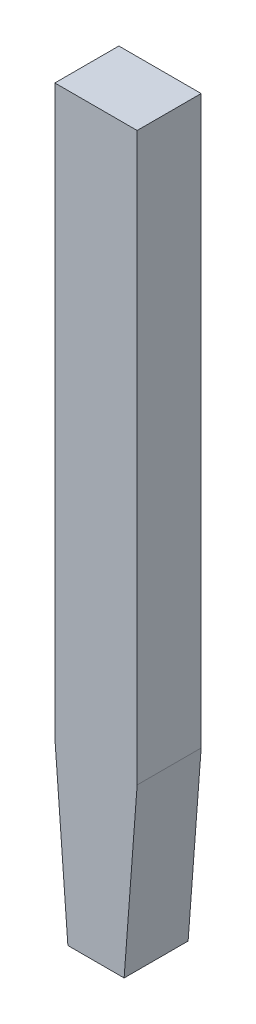
ISO-10303-21;
HEADER;
FILE_DESCRIPTION(('STEP AP214'),'2;1');
FILE_NAME('part.step','',(''),(''),'','','');
FILE_SCHEMA(('AUTOMOTIVE_DESIGN { 1 0 10303 214 1 1 1 1 }'));
ENDSEC;
DATA;
#1=APPLICATION_CONTEXT('core data for automotive mechanical design processes');
#2=APPLICATION_PROTOCOL_DEFINITION('international standard','automotive_design',2000,#1);
#3=PRODUCT_CONTEXT('',#1,'mechanical');
#4=PRODUCT('Part','Part','',(#3));
#5=PRODUCT_RELATED_PRODUCT_CATEGORY('part','',(#4));
#6=PRODUCT_DEFINITION_FORMATION('','',#4);
#7=PRODUCT_DEFINITION_CONTEXT('part definition',#1,'design');
#8=PRODUCT_DEFINITION('design','',#6,#7);
#9=PRODUCT_DEFINITION_SHAPE('','',#8);
#10=(LENGTH_UNIT() NAMED_UNIT(*) SI_UNIT(.MILLI.,.METRE.));
#11=(NAMED_UNIT(*) PLANE_ANGLE_UNIT() SI_UNIT($,.RADIAN.));
#12=(NAMED_UNIT(*) SI_UNIT($,.STERADIAN.) SOLID_ANGLE_UNIT());
#13=UNCERTAINTY_MEASURE_WITH_UNIT(LENGTH_MEASURE(1.E-05),#10,'distance_accuracy_value','');
#14=(GEOMETRIC_REPRESENTATION_CONTEXT(3) GLOBAL_UNCERTAINTY_ASSIGNED_CONTEXT((#13)) GLOBAL_UNIT_ASSIGNED_CONTEXT((#10,
#11,#12)) REPRESENTATION_CONTEXT('',''));
#15=CARTESIAN_POINT('',(0.,0.,0.));
#16=DIRECTION('',(0.,0.,1.));
#17=DIRECTION('',(1.,0.,0.));
#18=AXIS2_PLACEMENT_3D('',#15,#16,#17);
#19=CARTESIAN_POINT('',(45.33457889831,-0.5212621897839,0.8150000000459));
#20=DIRECTION('',(0.,0.,1.));
#21=DIRECTION('',(1.,0.,0.));
#22=AXIS2_PLACEMENT_3D('',#19,#20,#21);
#23=PLANE('',#22);
#24=DIRECTION('',(0.0747899482416361,0.997199309888456,0.));
#25=VECTOR('',#24,1.);
#26=CARTESIAN_POINT('',(45.93832889831,-15.17126218978,0.8150000000459));
#27=LINE('',#26,#25);
#28=CARTESIAN_POINT('',(45.93832889831,-15.17126218978,0.8150000000459));
#29=VERTEX_POINT('',#28);
#30=CARTESIAN_POINT('',(46.00957889831,-14.22126218978,0.8150000000459));
#31=VERTEX_POINT('',#30);
#32=EDGE_CURVE('E83',#29,#31,#27,.T.);
#33=ORIENTED_EDGE('',*,*,#32,.F.);
#34=DIRECTION('',(1.,0.,0.));
#35=VECTOR('',#34,1.);
#36=CARTESIAN_POINT('',(45.33457889831,-15.17126218978,0.8150000000459));
#37=LINE('',#36,#35);
#38=CARTESIAN_POINT('',(45.63082889831,-15.17126218978,0.8150000000459));
#39=VERTEX_POINT('',#38);
#40=EDGE_CURVE('E66',#39,#29,#37,.T.);
#41=ORIENTED_EDGE('',*,*,#40,.F.);
#42=DIRECTION('',(0.0747899482416361,-0.997199309888456,0.));
#43=VECTOR('',#42,1.);
#44=CARTESIAN_POINT('',(45.55957889831,-14.22126218978,0.8150000000459));
#45=LINE('',#44,#43);
#46=CARTESIAN_POINT('',(45.55957889831,-14.2212621897798,0.8150000000459));
#47=VERTEX_POINT('',#46);
#48=EDGE_CURVE('E20',#47,#39,#45,.T.);
#49=ORIENTED_EDGE('',*,*,#48,.F.);
#50=DIRECTION('',(0.,1.,0.));
#51=VECTOR('',#50,1.);
#52=CARTESIAN_POINT('',(45.55957889831,-7.321262189784,0.8150000000459));
#53=LINE('',#52,#51);
#54=CARTESIAN_POINT('',(45.55957889831,-11.12202888849,0.8150000000459));
#55=VERTEX_POINT('',#54);
#56=EDGE_CURVE('E96',#55,#47,#53,.F.);
#57=ORIENTED_EDGE('',*,*,#56,.F.);
#58=DIRECTION('',(1.,0.,0.));
#59=VECTOR('',#58,1.);
#60=CARTESIAN_POINT('',(44.47457889831,-11.12202888849,0.8150000000459));
#61=LINE('',#60,#59);
#62=CARTESIAN_POINT('',(46.00957889831,-11.12202888849,0.8150000000459));
#63=VERTEX_POINT('',#62);
#64=EDGE_CURVE('E89',#55,#63,#61,.T.);
#65=ORIENTED_EDGE('',*,*,#64,.T.);
#66=DIRECTION('',(0.,1.,0.));
#67=VECTOR('',#66,1.);
#68=CARTESIAN_POINT('',(46.00957889831,-7.321262189784,0.8150000000459));
#69=LINE('',#68,#67);
#70=EDGE_CURVE('E84',#31,#63,#69,.T.);
#71=ORIENTED_EDGE('',*,*,#70,.F.);
#72=EDGE_LOOP('',(#33,#41,#49,#57,#65,#71));
#73=FACE_BOUND('',#72,.T.);
#74=ADVANCED_FACE('F17',(#73),#23,.F.);
#75=CARTESIAN_POINT('',(46.00957889831,-7.321262189784,0.8150000000459));
#76=DIRECTION('',(1.,0.,0.));
#77=DIRECTION('',(0.,0.,-1.));
#78=AXIS2_PLACEMENT_3D('',#75,#76,#77);
#79=PLANE('',#78);
#80=DIRECTION('',(0.,1.,0.));
#81=VECTOR('',#80,1.);
#82=CARTESIAN_POINT('',(46.00957889831,-0.5212621897839,1.165000000046));
#83=LINE('',#82,#81);
#84=CARTESIAN_POINT('',(46.00957889831,-14.2212621897799,1.165000000046));
#85=VERTEX_POINT('',#84);
#86=CARTESIAN_POINT('',(46.00957889831,-11.12202888849,1.165000000046));
#87=VERTEX_POINT('',#86);
#88=EDGE_CURVE('E103',#85,#87,#83,.T.);
#89=ORIENTED_EDGE('',*,*,#88,.F.);
#90=DIRECTION('',(0.,0.,1.));
#91=VECTOR('',#90,1.);
#92=CARTESIAN_POINT('',(46.00957889831,-14.22126218978,0.8150000000459));
#93=LINE('',#92,#91);
#94=EDGE_CURVE('E100',#31,#85,#93,.T.);
#95=ORIENTED_EDGE('',*,*,#94,.F.);
#96=ORIENTED_EDGE('',*,*,#70,.T.);
#97=DIRECTION('',(0.,0.,-1.));
#98=VECTOR('',#97,1.);
#99=CARTESIAN_POINT('',(46.00957889831,-11.12202888849,-0.158278306686));
#100=LINE('',#99,#98);
#101=EDGE_CURVE('E91',#63,#87,#100,.F.);
#102=ORIENTED_EDGE('',*,*,#101,.T.);
#103=EDGE_LOOP('',(#89,#95,#96,#102));
#104=FACE_BOUND('',#103,.T.);
#105=ADVANCED_FACE('F124',(#104),#79,.T.);
#106=CARTESIAN_POINT('',(44.47457889831,-11.12202888849,-0.158278306686));
#107=DIRECTION('',(0.,-1.,0.));
#108=DIRECTION('',(0.,0.,-1.));
#109=AXIS2_PLACEMENT_3D('',#106,#107,#108);
#110=PLANE('',#109);
#111=ORIENTED_EDGE('',*,*,#64,.F.);
#112=DIRECTION('',(0.,0.,1.));
#113=VECTOR('',#112,1.);
#114=CARTESIAN_POINT('',(45.55957889831,-11.12202888849,0.8150000000459));
#115=LINE('',#114,#113);
#116=CARTESIAN_POINT('',(45.55957889831,-11.12202888849,1.165000000046));
#117=VERTEX_POINT('',#116);
#118=EDGE_CURVE('E93',#117,#55,#115,.F.);
#119=ORIENTED_EDGE('',*,*,#118,.F.);
#120=DIRECTION('',(1.,0.,0.));
#121=VECTOR('',#120,1.);
#122=CARTESIAN_POINT('',(45.33457889831,-11.12202888849,1.165000000046));
#123=LINE('',#122,#121);
#124=EDGE_CURVE('E106',#87,#117,#123,.F.);
#125=ORIENTED_EDGE('',*,*,#124,.F.);
#126=ORIENTED_EDGE('',*,*,#101,.F.);
#127=EDGE_LOOP('',(#111,#119,#125,#126));
#128=FACE_BOUND('',#127,.T.);
#129=ADVANCED_FACE('F125',(#128),#110,.F.);
#130=CARTESIAN_POINT('',(45.55957889831,-7.321262189784,0.8150000000459));
#131=DIRECTION('',(-1.,0.,0.));
#132=DIRECTION('',(0.,0.,1.));
#133=AXIS2_PLACEMENT_3D('',#130,#131,#132);
#134=PLANE('',#133);
#135=ORIENTED_EDGE('',*,*,#56,.T.);
#136=DIRECTION('',(0.,0.,1.));
#137=VECTOR('',#136,1.);
#138=CARTESIAN_POINT('',(45.55957889831,-14.22126218978,0.8150000000459));
#139=LINE('',#138,#137);
#140=CARTESIAN_POINT('',(45.55957889831,-14.2212621897799,1.165000000046));
#141=VERTEX_POINT('',#140);
#142=EDGE_CURVE('E73',#141,#47,#139,.F.);
#143=ORIENTED_EDGE('',*,*,#142,.F.);
#144=DIRECTION('',(0.,1.,0.));
#145=VECTOR('',#144,1.);
#146=CARTESIAN_POINT('',(45.55957889831,-0.5212621897839,1.165000000046));
#147=LINE('',#146,#145);
#148=EDGE_CURVE('E109',#117,#141,#147,.F.);
#149=ORIENTED_EDGE('',*,*,#148,.F.);
#150=ORIENTED_EDGE('',*,*,#118,.T.);
#151=EDGE_LOOP('',(#135,#143,#149,#150));
#152=FACE_BOUND('',#151,.T.);
#153=ADVANCED_FACE('F119',(#152),#134,.T.);
#154=CARTESIAN_POINT('',(45.55957889831,-14.22126218978,0.8150000000459));
#155=DIRECTION('',(-0.997199309888458,-0.0747899482416168,0.));
#156=DIRECTION('',(0.0747899482416168,-0.997199309888458,0.));
#157=AXIS2_PLACEMENT_3D('',#154,#155,#156);
#158=PLANE('',#157);
#159=DIRECTION('',(0.0747899482416361,-0.997199309888456,0.));
#160=VECTOR('',#159,1.);
#161=CARTESIAN_POINT('',(45.55957889831,-14.22126218978,1.165000000046));
#162=LINE('',#161,#160);
#163=CARTESIAN_POINT('',(45.63082889831,-15.17126218978,1.165000000046));
#164=VERTEX_POINT('',#163);
#165=EDGE_CURVE('E112',#141,#164,#162,.T.);
#166=ORIENTED_EDGE('',*,*,#165,.F.);
#167=ORIENTED_EDGE('',*,*,#142,.T.);
#168=ORIENTED_EDGE('',*,*,#48,.T.);
#169=DIRECTION('',(0.,0.,1.));
#170=VECTOR('',#169,1.);
#171=CARTESIAN_POINT('',(45.63082889831,-15.17126218978,-0.8137967800219));
#172=LINE('',#171,#170);
#173=EDGE_CURVE('E72',#39,#164,#172,.T.);
#174=ORIENTED_EDGE('',*,*,#173,.T.);
#175=EDGE_LOOP('',(#166,#167,#168,#174));
#176=FACE_BOUND('',#175,.T.);
#177=ADVANCED_FACE('F71',(#176),#158,.T.);
#178=CARTESIAN_POINT('',(38.93957889831,-15.17126218978,-0.8137967800219));
#179=DIRECTION('',(0.,1.,0.));
#180=DIRECTION('',(0.,0.,1.));
#181=AXIS2_PLACEMENT_3D('',#178,#179,#180);
#182=PLANE('',#181);
#183=ORIENTED_EDGE('',*,*,#40,.T.);
#184=DIRECTION('',(0.,0.,1.));
#185=VECTOR('',#184,1.);
#186=CARTESIAN_POINT('',(45.93832889831,-15.17126218978,0.8150000000459));
#187=LINE('',#186,#185);
#188=CARTESIAN_POINT('',(45.93832889831,-15.17126218978,1.165000000046));
#189=VERTEX_POINT('',#188);
#190=EDGE_CURVE('E35',#189,#29,#187,.F.);
#191=ORIENTED_EDGE('',*,*,#190,.F.);
#192=DIRECTION('',(1.,0.,0.));
#193=VECTOR('',#192,1.);
#194=CARTESIAN_POINT('',(45.33457889831,-15.17126218978,1.165000000046));
#195=LINE('',#194,#193);
#196=EDGE_CURVE('E26',#164,#189,#195,.T.);
#197=ORIENTED_EDGE('',*,*,#196,.F.);
#198=ORIENTED_EDGE('',*,*,#173,.F.);
#199=EDGE_LOOP('',(#183,#191,#197,#198));
#200=FACE_BOUND('',#199,.T.);
#201=ADVANCED_FACE('F77',(#200),#182,.F.);
#202=CARTESIAN_POINT('',(46.00957889831,-14.22126218978,0.8150000000459));
#203=DIRECTION('',(0.997199309888458,-0.0747899482416168,0.));
#204=DIRECTION('',(0.0747899482416168,0.997199309888458,0.));
#205=AXIS2_PLACEMENT_3D('',#202,#203,#204);
#206=PLANE('',#205);
#207=ORIENTED_EDGE('',*,*,#32,.T.);
#208=ORIENTED_EDGE('',*,*,#94,.T.);
#209=DIRECTION('',(0.0747899482416361,0.997199309888456,0.));
#210=VECTOR('',#209,1.);
#211=CARTESIAN_POINT('',(45.93832889831,-15.17126218978,1.165000000046));
#212=LINE('',#211,#210);
#213=EDGE_CURVE('E11',#189,#85,#212,.T.);
#214=ORIENTED_EDGE('',*,*,#213,.F.);
#215=ORIENTED_EDGE('',*,*,#190,.T.);
#216=EDGE_LOOP('',(#207,#208,#214,#215));
#217=FACE_BOUND('',#216,.T.);
#218=ADVANCED_FACE('F127',(#217),#206,.T.);
#219=CARTESIAN_POINT('',(45.33457889831,-0.5212621897839,1.165000000046));
#220=DIRECTION('',(0.,0.,1.));
#221=DIRECTION('',(1.,0.,0.));
#222=AXIS2_PLACEMENT_3D('',#219,#220,#221);
#223=PLANE('',#222);
#224=ORIENTED_EDGE('',*,*,#196,.T.);
#225=ORIENTED_EDGE('',*,*,#213,.T.);
#226=ORIENTED_EDGE('',*,*,#88,.T.);
#227=ORIENTED_EDGE('',*,*,#124,.T.);
#228=ORIENTED_EDGE('',*,*,#148,.T.);
#229=ORIENTED_EDGE('',*,*,#165,.T.);
#230=EDGE_LOOP('',(#224,#225,#226,#227,#228,#229));
#231=FACE_BOUND('',#230,.T.);
#232=ADVANCED_FACE('F115',(#231),#223,.T.);
#233=CLOSED_SHELL('',(#74,#105,#129,#153,#177,#201,#218,#232));
#234=MANIFOLD_SOLID_BREP('B1',#233);
#235=ADVANCED_BREP_SHAPE_REPRESENTATION('',(#18,#234),#14);
#236=SHAPE_DEFINITION_REPRESENTATION(#9,#235);
ENDSEC;
END-ISO-10303-21;
